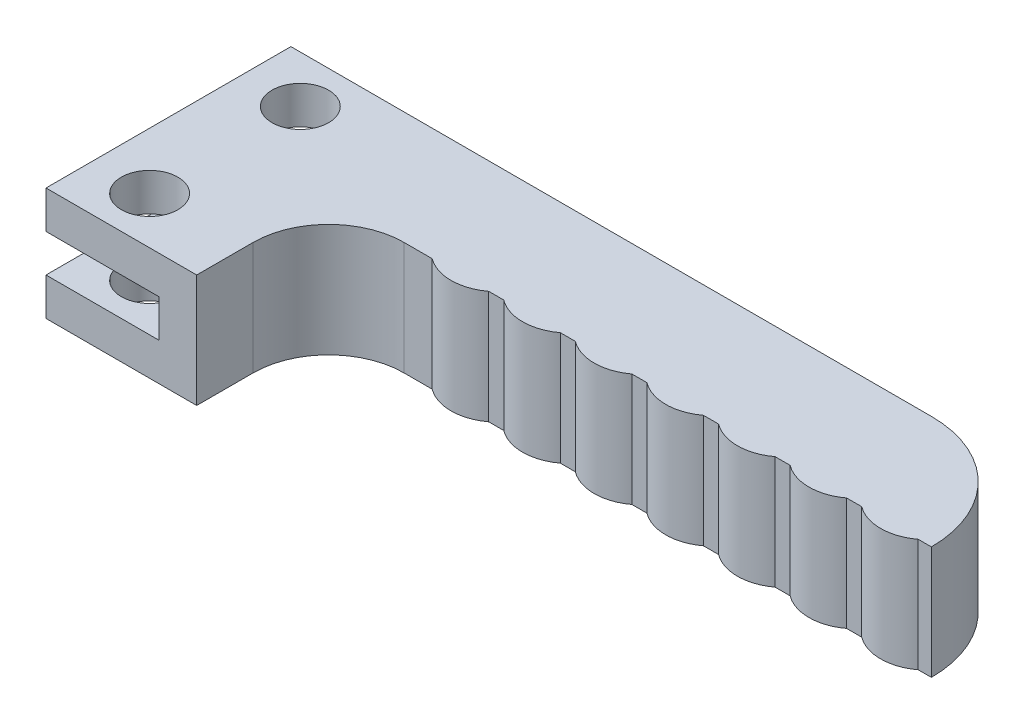
ISO-10303-21;
HEADER;
FILE_DESCRIPTION(('STEP AP214'),'2;1');
FILE_NAME('part.step','',(''),(''),'','','');
FILE_SCHEMA(('AUTOMOTIVE_DESIGN { 1 0 10303 214 1 1 1 1 }'));
ENDSEC;
DATA;
#1=APPLICATION_CONTEXT('core data for automotive mechanical design processes');
#2=APPLICATION_PROTOCOL_DEFINITION('international standard','automotive_design',2000,#1);
#3=PRODUCT_CONTEXT('',#1,'mechanical');
#4=PRODUCT('Part','Part','',(#3));
#5=PRODUCT_RELATED_PRODUCT_CATEGORY('part','',(#4));
#6=PRODUCT_DEFINITION_FORMATION('','',#4);
#7=PRODUCT_DEFINITION_CONTEXT('part definition',#1,'design');
#8=PRODUCT_DEFINITION('design','',#6,#7);
#9=PRODUCT_DEFINITION_SHAPE('','',#8);
#10=(LENGTH_UNIT() NAMED_UNIT(*) SI_UNIT(.MILLI.,.METRE.));
#11=(NAMED_UNIT(*) PLANE_ANGLE_UNIT() SI_UNIT($,.RADIAN.));
#12=(NAMED_UNIT(*) SI_UNIT($,.STERADIAN.) SOLID_ANGLE_UNIT());
#13=UNCERTAINTY_MEASURE_WITH_UNIT(LENGTH_MEASURE(1.E-05),#10,'distance_accuracy_value','');
#14=(GEOMETRIC_REPRESENTATION_CONTEXT(3) GLOBAL_UNCERTAINTY_ASSIGNED_CONTEXT((#13)) GLOBAL_UNIT_ASSIGNED_CONTEXT((#10,
#11,#12)) REPRESENTATION_CONTEXT('',''));
#15=CARTESIAN_POINT('',(0.,0.,0.));
#16=DIRECTION('',(0.,0.,1.));
#17=DIRECTION('',(1.,0.,0.));
#18=AXIS2_PLACEMENT_3D('',#15,#16,#17);
#19=CARTESIAN_POINT('',(-17.,0.,4.));
#20=DIRECTION('',(0.,1.,0.));
#21=DIRECTION('',(0.,0.,1.));
#22=AXIS2_PLACEMENT_3D('',#19,#20,#21);
#23=CYLINDRICAL_SURFACE('',#22,1.5);
#24=CARTESIAN_POINT('',(-17.,0.,4.));
#25=DIRECTION('',(0.,1.,0.));
#26=DIRECTION('',(0.,0.,1.));
#27=AXIS2_PLACEMENT_3D('',#24,#25,#26);
#28=CIRCLE('',#27,1.5);
#29=CARTESIAN_POINT('',(-17.,0.,5.5));
#30=VERTEX_POINT('',#29);
#31=EDGE_CURVE('E302',#30,#30,#28,.F.);
#32=ORIENTED_EDGE('',*,*,#31,.T.);
#33=EDGE_LOOP('',(#32));
#34=FACE_BOUND('',#33,.T.);
#35=CARTESIAN_POINT('',(-17.,2.,4.));
#36=DIRECTION('',(0.,1.,0.));
#37=DIRECTION('',(0.,0.,1.));
#38=AXIS2_PLACEMENT_3D('',#35,#36,#37);
#39=CIRCLE('',#38,1.5);
#40=CARTESIAN_POINT('',(-17.,2.,5.5));
#41=VERTEX_POINT('',#40);
#42=EDGE_CURVE('E20',#41,#41,#39,.T.);
#43=ORIENTED_EDGE('',*,*,#42,.T.);
#44=EDGE_LOOP('',(#43));
#45=FACE_BOUND('',#44,.T.);
#46=ADVANCED_FACE('F17',(#34,#45),#23,.F.);
#47=CARTESIAN_POINT('',(-17.,0.,-4.));
#48=DIRECTION('',(0.,1.,0.));
#49=DIRECTION('',(0.,0.,1.));
#50=AXIS2_PLACEMENT_3D('',#47,#48,#49);
#51=CYLINDRICAL_SURFACE('',#50,1.5);
#52=CARTESIAN_POINT('',(-17.,0.,-4.));
#53=DIRECTION('',(0.,1.,0.));
#54=DIRECTION('',(0.,0.,1.));
#55=AXIS2_PLACEMENT_3D('',#52,#53,#54);
#56=CIRCLE('',#55,1.5);
#57=CARTESIAN_POINT('',(-17.,0.,-2.5));
#58=VERTEX_POINT('',#57);
#59=EDGE_CURVE('E298',#58,#58,#56,.F.);
#60=ORIENTED_EDGE('',*,*,#59,.T.);
#61=EDGE_LOOP('',(#60));
#62=FACE_BOUND('',#61,.T.);
#63=CARTESIAN_POINT('',(-17.,2.,-4.));
#64=DIRECTION('',(0.,1.,0.));
#65=DIRECTION('',(0.,0.,1.));
#66=AXIS2_PLACEMENT_3D('',#63,#64,#65);
#67=CIRCLE('',#66,1.5);
#68=CARTESIAN_POINT('',(-17.,2.,-2.5));
#69=VERTEX_POINT('',#68);
#70=EDGE_CURVE('E190',#69,#69,#67,.T.);
#71=ORIENTED_EDGE('',*,*,#70,.T.);
#72=EDGE_LOOP('',(#71));
#73=FACE_BOUND('',#72,.T.);
#74=ADVANCED_FACE('F322',(#62,#73),#51,.F.);
#75=CARTESIAN_POINT('',(-20.,6.,6.5));
#76=DIRECTION('',(1.,0.,0.));
#77=DIRECTION('',(0.,0.,-1.));
#78=AXIS2_PLACEMENT_3D('',#75,#76,#77);
#79=PLANE('',#78);
#80=DIRECTION('',(0.,0.,-1.));
#81=VECTOR('',#80,1.);
#82=CARTESIAN_POINT('',(-20.,2.,-6.5));
#83=LINE('',#82,#81);
#84=CARTESIAN_POINT('',(-20.,2.,6.5));
#85=VERTEX_POINT('',#84);
#86=CARTESIAN_POINT('',(-20.,2.,-6.5));
#87=VERTEX_POINT('',#86);
#88=EDGE_CURVE('E179',#85,#87,#83,.T.);
#89=ORIENTED_EDGE('',*,*,#88,.T.);
#90=DIRECTION('',(0.,1.,0.));
#91=VECTOR('',#90,1.);
#92=CARTESIAN_POINT('',(-20.,6.,-6.5));
#93=LINE('',#92,#91);
#94=CARTESIAN_POINT('',(-20.,0.,-6.5));
#95=VERTEX_POINT('',#94);
#96=EDGE_CURVE('E183',#87,#95,#93,.F.);
#97=ORIENTED_EDGE('',*,*,#96,.T.);
#98=DIRECTION('',(0.,0.,1.));
#99=VECTOR('',#98,1.);
#100=CARTESIAN_POINT('',(-20.,0.,0.));
#101=LINE('',#100,#99);
#102=CARTESIAN_POINT('',(-20.,0.,6.5));
#103=VERTEX_POINT('',#102);
#104=EDGE_CURVE('E301',#95,#103,#101,.T.);
#105=ORIENTED_EDGE('',*,*,#104,.T.);
#106=DIRECTION('',(0.,1.,0.));
#107=VECTOR('',#106,1.);
#108=CARTESIAN_POINT('',(-20.,6.,6.5));
#109=LINE('',#108,#107);
#110=EDGE_CURVE('E186',#103,#85,#109,.T.);
#111=ORIENTED_EDGE('',*,*,#110,.T.);
#112=EDGE_LOOP('',(#89,#97,#105,#111));
#113=FACE_BOUND('',#112,.T.);
#114=ADVANCED_FACE('F181',(#113),#79,.F.);
#115=CARTESIAN_POINT('',(-20.,2.,-6.5));
#116=DIRECTION('',(0.,-1.,0.));
#117=DIRECTION('',(0.,0.,-1.));
#118=AXIS2_PLACEMENT_3D('',#115,#116,#117);
#119=PLANE('',#118);
#120=DIRECTION('',(0.,0.,-1.));
#121=VECTOR('',#120,1.);
#122=CARTESIAN_POINT('',(-14.,2.,-6.5));
#123=LINE('',#122,#121);
#124=CARTESIAN_POINT('',(-14.,2.,6.5));
#125=VERTEX_POINT('',#124);
#126=CARTESIAN_POINT('',(-14.,2.,-6.5));
#127=VERTEX_POINT('',#126);
#128=EDGE_CURVE('E189',#125,#127,#123,.T.);
#129=ORIENTED_EDGE('',*,*,#128,.T.);
#130=DIRECTION('',(1.,0.,0.));
#131=VECTOR('',#130,1.);
#132=CARTESIAN_POINT('',(20.,2.,-6.5));
#133=LINE('',#132,#131);
#134=EDGE_CURVE('E193',#127,#87,#133,.F.);
#135=ORIENTED_EDGE('',*,*,#134,.T.);
#136=ORIENTED_EDGE('',*,*,#88,.F.);
#137=DIRECTION('',(-1.,0.,0.));
#138=VECTOR('',#137,1.);
#139=CARTESIAN_POINT('',(20.,2.,6.5));
#140=LINE('',#139,#138);
#141=EDGE_CURVE('E467',#85,#125,#140,.F.);
#142=ORIENTED_EDGE('',*,*,#141,.T.);
#143=EDGE_LOOP('',(#129,#135,#136,#142));
#144=FACE_BOUND('',#143,.T.);
#145=ORIENTED_EDGE('',*,*,#70,.F.);
#146=EDGE_LOOP('',(#145));
#147=FACE_BOUND('',#146,.T.);
#148=ORIENTED_EDGE('',*,*,#42,.F.);
#149=EDGE_LOOP('',(#148));
#150=FACE_BOUND('',#149,.T.);
#151=ADVANCED_FACE('F194',(#144,#147,#150),#119,.F.);
#152=CARTESIAN_POINT('',(-14.,4.,-6.5));
#153=DIRECTION('',(1.,0.,0.));
#154=DIRECTION('',(0.,0.,-1.));
#155=AXIS2_PLACEMENT_3D('',#152,#153,#154);
#156=PLANE('',#155);
#157=DIRECTION('',(0.,0.,1.));
#158=VECTOR('',#157,1.);
#159=CARTESIAN_POINT('',(-14.,4.,-6.5));
#160=LINE('',#159,#158);
#161=CARTESIAN_POINT('',(-14.,4.,6.5));
#162=VERTEX_POINT('',#161);
#163=CARTESIAN_POINT('',(-14.,4.,-6.5));
#164=VERTEX_POINT('',#163);
#165=EDGE_CURVE('E155',#162,#164,#160,.F.);
#166=ORIENTED_EDGE('',*,*,#165,.T.);
#167=DIRECTION('',(0.,1.,0.));
#168=VECTOR('',#167,1.);
#169=CARTESIAN_POINT('',(-14.,6.,-6.5));
#170=LINE('',#169,#168);
#171=EDGE_CURVE('E199',#164,#127,#170,.F.);
#172=ORIENTED_EDGE('',*,*,#171,.T.);
#173=ORIENTED_EDGE('',*,*,#128,.F.);
#174=DIRECTION('',(0.,1.,0.));
#175=VECTOR('',#174,1.);
#176=CARTESIAN_POINT('',(-14.,6.,6.5));
#177=LINE('',#176,#175);
#178=EDGE_CURVE('E479',#125,#162,#177,.T.);
#179=ORIENTED_EDGE('',*,*,#178,.T.);
#180=EDGE_LOOP('',(#166,#172,#173,#179));
#181=FACE_BOUND('',#180,.T.);
#182=ADVANCED_FACE('F313',(#181),#156,.F.);
#183=CARTESIAN_POINT('',(20.,0.,-0.500000000000003));
#184=DIRECTION('',(0.,0.,-1.));
#185=DIRECTION('',(-1.,0.,0.));
#186=AXIS2_PLACEMENT_3D('',#183,#184,#185);
#187=PLANE('',#186);
#188=DIRECTION('',(0.,-1.,0.));
#189=VECTOR('',#188,1.);
#190=CARTESIAN_POINT('',(-6.50000000000001,6.,-0.5));
#191=LINE('',#190,#189);
#192=CARTESIAN_POINT('',(-6.50000000000001,6.,-0.5));
#193=VERTEX_POINT('',#192);
#194=CARTESIAN_POINT('',(-6.50000000000001,0.,-0.5));
#195=VERTEX_POINT('',#194);
#196=EDGE_CURVE('E285',#193,#195,#191,.T.);
#197=ORIENTED_EDGE('',*,*,#196,.F.);
#198=DIRECTION('',(-1.,0.,0.));
#199=VECTOR('',#198,1.);
#200=CARTESIAN_POINT('',(20.,6.,-0.500000000000003));
#201=LINE('',#200,#199);
#202=CARTESIAN_POINT('',(-8.,6.,-0.5));
#203=VERTEX_POINT('',#202);
#204=EDGE_CURVE('E432',#203,#193,#201,.F.);
#205=ORIENTED_EDGE('',*,*,#204,.F.);
#206=DIRECTION('',(0.,-1.,0.));
#207=VECTOR('',#206,1.);
#208=CARTESIAN_POINT('',(-8.,0.,-0.5));
#209=LINE('',#208,#207);
#210=CARTESIAN_POINT('',(-8.,0.,-0.5));
#211=VERTEX_POINT('',#210);
#212=EDGE_CURVE('E293',#203,#211,#209,.T.);
#213=ORIENTED_EDGE('',*,*,#212,.T.);
#214=DIRECTION('',(1.,0.,0.));
#215=VECTOR('',#214,1.);
#216=CARTESIAN_POINT('',(0.,0.,-0.5));
#217=LINE('',#216,#215);
#218=EDGE_CURVE('E435',#211,#195,#217,.T.);
#219=ORIENTED_EDGE('',*,*,#218,.T.);
#220=EDGE_LOOP('',(#197,#205,#213,#219));
#221=FACE_BOUND('',#220,.T.);
#222=ADVANCED_FACE('F320',(#221),#187,.F.);
#223=CARTESIAN_POINT('',(20.,0.,-0.500000000000003));
#224=DIRECTION('',(0.,0.,-1.));
#225=DIRECTION('',(-1.,0.,0.));
#226=AXIS2_PLACEMENT_3D('',#223,#224,#225);
#227=PLANE('',#226);
#228=DIRECTION('',(0.,-1.,0.));
#229=VECTOR('',#228,1.);
#230=CARTESIAN_POINT('',(-2.70000000000001,6.,-0.5));
#231=LINE('',#230,#229);
#232=CARTESIAN_POINT('',(-2.70000000000001,6.,-0.5));
#233=VERTEX_POINT('',#232);
#234=CARTESIAN_POINT('',(-2.70000000000001,0.,-0.5));
#235=VERTEX_POINT('',#234);
#236=EDGE_CURVE('E280',#233,#235,#231,.T.);
#237=ORIENTED_EDGE('',*,*,#236,.F.);
#238=DIRECTION('',(-1.,0.,0.));
#239=VECTOR('',#238,1.);
#240=CARTESIAN_POINT('',(20.,6.,-0.500000000000003));
#241=LINE('',#240,#239);
#242=CARTESIAN_POINT('',(-3.5,6.,-0.5));
#243=VERTEX_POINT('',#242);
#244=EDGE_CURVE('E440',#243,#233,#241,.F.);
#245=ORIENTED_EDGE('',*,*,#244,.F.);
#246=DIRECTION('',(0.,-1.,0.));
#247=VECTOR('',#246,1.);
#248=CARTESIAN_POINT('',(-3.5,6.,-0.5));
#249=LINE('',#248,#247);
#250=CARTESIAN_POINT('',(-3.5,0.,-0.5));
#251=VERTEX_POINT('',#250);
#252=EDGE_CURVE('E289',#251,#243,#249,.F.);
#253=ORIENTED_EDGE('',*,*,#252,.F.);
#254=DIRECTION('',(1.,0.,0.));
#255=VECTOR('',#254,1.);
#256=CARTESIAN_POINT('',(0.,0.,-0.5));
#257=LINE('',#256,#255);
#258=EDGE_CURVE('E538',#251,#235,#257,.T.);
#259=ORIENTED_EDGE('',*,*,#258,.T.);
#260=EDGE_LOOP('',(#237,#245,#253,#259));
#261=FACE_BOUND('',#260,.T.);
#262=ADVANCED_FACE('F420',(#261),#227,.F.);
#263=CARTESIAN_POINT('',(20.,0.,-0.500000000000003));
#264=DIRECTION('',(0.,0.,-1.));
#265=DIRECTION('',(-1.,0.,0.));
#266=AXIS2_PLACEMENT_3D('',#263,#264,#265);
#267=PLANE('',#266);
#268=DIRECTION('',(0.,-1.,0.));
#269=VECTOR('',#268,1.);
#270=CARTESIAN_POINT('',(1.09999999999999,6.,-0.5));
#271=LINE('',#270,#269);
#272=CARTESIAN_POINT('',(1.09999999999999,6.,-0.5));
#273=VERTEX_POINT('',#272);
#274=CARTESIAN_POINT('',(1.09999999999999,0.,-0.5));
#275=VERTEX_POINT('',#274);
#276=EDGE_CURVE('E275',#273,#275,#271,.T.);
#277=ORIENTED_EDGE('',*,*,#276,.F.);
#278=DIRECTION('',(-1.,0.,0.));
#279=VECTOR('',#278,1.);
#280=CARTESIAN_POINT('',(20.,6.,-0.500000000000003));
#281=LINE('',#280,#279);
#282=CARTESIAN_POINT('',(0.299999999999998,6.,-0.500000000000001));
#283=VERTEX_POINT('',#282);
#284=EDGE_CURVE('E445',#283,#273,#281,.F.);
#285=ORIENTED_EDGE('',*,*,#284,.F.);
#286=DIRECTION('',(0.,-1.,0.));
#287=VECTOR('',#286,1.);
#288=CARTESIAN_POINT('',(0.299999999999997,6.,-0.5));
#289=LINE('',#288,#287);
#290=CARTESIAN_POINT('',(0.299999999999997,0.,-0.5));
#291=VERTEX_POINT('',#290);
#292=EDGE_CURVE('E284',#291,#283,#289,.F.);
#293=ORIENTED_EDGE('',*,*,#292,.F.);
#294=DIRECTION('',(1.,0.,0.));
#295=VECTOR('',#294,1.);
#296=CARTESIAN_POINT('',(0.,0.,-0.5));
#297=LINE('',#296,#295);
#298=EDGE_CURVE('E536',#291,#275,#297,.T.);
#299=ORIENTED_EDGE('',*,*,#298,.T.);
#300=EDGE_LOOP('',(#277,#285,#293,#299));
#301=FACE_BOUND('',#300,.T.);
#302=ADVANCED_FACE('F416',(#301),#267,.F.);
#303=CARTESIAN_POINT('',(20.,0.,-0.500000000000003));
#304=DIRECTION('',(0.,0.,-1.));
#305=DIRECTION('',(-1.,0.,0.));
#306=AXIS2_PLACEMENT_3D('',#303,#304,#305);
#307=PLANE('',#306);
#308=DIRECTION('',(0.,-1.,0.));
#309=VECTOR('',#308,1.);
#310=CARTESIAN_POINT('',(4.9,6.,-0.499999999999999));
#311=LINE('',#310,#309);
#312=CARTESIAN_POINT('',(4.9,6.,-0.5));
#313=VERTEX_POINT('',#312);
#314=CARTESIAN_POINT('',(4.9,0.,-0.5));
#315=VERTEX_POINT('',#314);
#316=EDGE_CURVE('E270',#313,#315,#311,.T.);
#317=ORIENTED_EDGE('',*,*,#316,.F.);
#318=DIRECTION('',(-1.,0.,0.));
#319=VECTOR('',#318,1.);
#320=CARTESIAN_POINT('',(20.,6.,-0.500000000000003));
#321=LINE('',#320,#319);
#322=CARTESIAN_POINT('',(4.1,6.,-0.500000000000001));
#323=VERTEX_POINT('',#322);
#324=EDGE_CURVE('E544',#323,#313,#321,.F.);
#325=ORIENTED_EDGE('',*,*,#324,.F.);
#326=DIRECTION('',(0.,-1.,0.));
#327=VECTOR('',#326,1.);
#328=CARTESIAN_POINT('',(4.1,6.,-0.5));
#329=LINE('',#328,#327);
#330=CARTESIAN_POINT('',(4.1,0.,-0.5));
#331=VERTEX_POINT('',#330);
#332=EDGE_CURVE('E279',#331,#323,#329,.F.);
#333=ORIENTED_EDGE('',*,*,#332,.F.);
#334=DIRECTION('',(1.,0.,0.));
#335=VECTOR('',#334,1.);
#336=CARTESIAN_POINT('',(0.,0.,-0.5));
#337=LINE('',#336,#335);
#338=EDGE_CURVE('E534',#331,#315,#337,.T.);
#339=ORIENTED_EDGE('',*,*,#338,.T.);
#340=EDGE_LOOP('',(#317,#325,#333,#339));
#341=FACE_BOUND('',#340,.T.);
#342=ADVANCED_FACE('F412',(#341),#307,.F.);
#343=CARTESIAN_POINT('',(20.,0.,-0.500000000000003));
#344=DIRECTION('',(0.,0.,-1.));
#345=DIRECTION('',(-1.,0.,0.));
#346=AXIS2_PLACEMENT_3D('',#343,#344,#345);
#347=PLANE('',#346);
#348=DIRECTION('',(0.,-1.,0.));
#349=VECTOR('',#348,1.);
#350=CARTESIAN_POINT('',(8.7,6.,-0.5));
#351=LINE('',#350,#349);
#352=CARTESIAN_POINT('',(8.69999999999999,6.,-0.500000000000001));
#353=VERTEX_POINT('',#352);
#354=CARTESIAN_POINT('',(8.7,0.,-0.5));
#355=VERTEX_POINT('',#354);
#356=EDGE_CURVE('E265',#353,#355,#351,.T.);
#357=ORIENTED_EDGE('',*,*,#356,.F.);
#358=DIRECTION('',(-1.,0.,0.));
#359=VECTOR('',#358,1.);
#360=CARTESIAN_POINT('',(20.,6.,-0.500000000000003));
#361=LINE('',#360,#359);
#362=CARTESIAN_POINT('',(7.9,6.,-0.500000000000001));
#363=VERTEX_POINT('',#362);
#364=EDGE_CURVE('E542',#363,#353,#361,.F.);
#365=ORIENTED_EDGE('',*,*,#364,.F.);
#366=DIRECTION('',(0.,-1.,0.));
#367=VECTOR('',#366,1.);
#368=CARTESIAN_POINT('',(7.9,6.,-0.5));
#369=LINE('',#368,#367);
#370=CARTESIAN_POINT('',(7.9,0.,-0.5));
#371=VERTEX_POINT('',#370);
#372=EDGE_CURVE('E274',#371,#363,#369,.F.);
#373=ORIENTED_EDGE('',*,*,#372,.F.);
#374=DIRECTION('',(1.,0.,0.));
#375=VECTOR('',#374,1.);
#376=CARTESIAN_POINT('',(0.,0.,-0.5));
#377=LINE('',#376,#375);
#378=EDGE_CURVE('E532',#371,#355,#377,.T.);
#379=ORIENTED_EDGE('',*,*,#378,.T.);
#380=EDGE_LOOP('',(#357,#365,#373,#379));
#381=FACE_BOUND('',#380,.T.);
#382=ADVANCED_FACE('F408',(#381),#347,.F.);
#383=CARTESIAN_POINT('',(20.,0.,-0.500000000000003));
#384=DIRECTION('',(0.,0.,-1.));
#385=DIRECTION('',(-1.,0.,0.));
#386=AXIS2_PLACEMENT_3D('',#383,#384,#385);
#387=PLANE('',#386);
#388=DIRECTION('',(0.,-1.,0.));
#389=VECTOR('',#388,1.);
#390=CARTESIAN_POINT('',(12.5,6.,-0.5));
#391=LINE('',#390,#389);
#392=CARTESIAN_POINT('',(12.5,6.,-0.500000000000001));
#393=VERTEX_POINT('',#392);
#394=CARTESIAN_POINT('',(12.5,0.,-0.5));
#395=VERTEX_POINT('',#394);
#396=EDGE_CURVE('E260',#393,#395,#391,.T.);
#397=ORIENTED_EDGE('',*,*,#396,.F.);
#398=DIRECTION('',(-1.,0.,0.));
#399=VECTOR('',#398,1.);
#400=CARTESIAN_POINT('',(20.,6.,-0.500000000000003));
#401=LINE('',#400,#399);
#402=CARTESIAN_POINT('',(11.7,6.,-0.500000000000002));
#403=VERTEX_POINT('',#402);
#404=EDGE_CURVE('E304',#403,#393,#401,.F.);
#405=ORIENTED_EDGE('',*,*,#404,.F.);
#406=DIRECTION('',(0.,-1.,0.));
#407=VECTOR('',#406,1.);
#408=CARTESIAN_POINT('',(11.7,6.,-0.500000000000001));
#409=LINE('',#408,#407);
#410=CARTESIAN_POINT('',(11.7,0.,-0.500000000000001));
#411=VERTEX_POINT('',#410);
#412=EDGE_CURVE('E269',#411,#403,#409,.F.);
#413=ORIENTED_EDGE('',*,*,#412,.F.);
#414=DIRECTION('',(1.,0.,0.));
#415=VECTOR('',#414,1.);
#416=CARTESIAN_POINT('',(0.,0.,-0.5));
#417=LINE('',#416,#415);
#418=EDGE_CURVE('E530',#411,#395,#417,.T.);
#419=ORIENTED_EDGE('',*,*,#418,.T.);
#420=EDGE_LOOP('',(#397,#405,#413,#419));
#421=FACE_BOUND('',#420,.T.);
#422=ADVANCED_FACE('F404',(#421),#387,.F.);
#423=CARTESIAN_POINT('',(0.,0.,0.));
#424=DIRECTION('',(0.,1.,0.));
#425=DIRECTION('',(0.,0.,1.));
#426=AXIS2_PLACEMENT_3D('',#423,#424,#425);
#427=PLANE('',#426);
#428=CARTESIAN_POINT('',(14.,0.,-0.500000000000001));
#429=DIRECTION('',(0.,-1.,0.));
#430=DIRECTION('',(0.,0.,-1.));
#431=AXIS2_PLACEMENT_3D('',#428,#429,#430);
#432=CIRCLE('',#431,6.);
#433=CARTESIAN_POINT('',(20.,0.,-0.500000000000003));
#434=VERTEX_POINT('',#433);
#435=CARTESIAN_POINT('',(14.,0.,-6.5));
#436=VERTEX_POINT('',#435);
#437=EDGE_CURVE('E294',#434,#436,#432,.F.);
#438=ORIENTED_EDGE('',*,*,#437,.F.);
#439=DIRECTION('',(-1.,0.,0.));
#440=VECTOR('',#439,1.);
#441=CARTESIAN_POINT('',(20.,0.,-0.500000000000003));
#442=LINE('',#441,#440);
#443=CARTESIAN_POINT('',(19.3,0.,-0.500000000000002));
#444=VERTEX_POINT('',#443);
#445=EDGE_CURVE('E146',#434,#444,#442,.T.);
#446=ORIENTED_EDGE('',*,*,#445,.T.);
#447=CARTESIAN_POINT('',(17.8,0.,-2.5));
#448=DIRECTION('',(0.,-1.,0.));
#449=DIRECTION('',(0.,0.,-1.));
#450=AXIS2_PLACEMENT_3D('',#447,#448,#449);
#451=CIRCLE('',#450,2.5);
#452=CARTESIAN_POINT('',(16.3,0.,-0.500000000000001));
#453=VERTEX_POINT('',#452);
#454=EDGE_CURVE('E256',#453,#444,#451,.F.);
#455=ORIENTED_EDGE('',*,*,#454,.F.);
#456=DIRECTION('',(-1.,0.,0.));
#457=VECTOR('',#456,1.);
#458=CARTESIAN_POINT('',(20.,0.,-0.500000000000003));
#459=LINE('',#458,#457);
#460=CARTESIAN_POINT('',(15.5,0.,-0.500000000000001));
#461=VERTEX_POINT('',#460);
#462=EDGE_CURVE('E483',#453,#461,#459,.T.);
#463=ORIENTED_EDGE('',*,*,#462,.T.);
#464=CARTESIAN_POINT('',(14.,0.,-2.5));
#465=DIRECTION('',(0.,-1.,0.));
#466=DIRECTION('',(0.,0.,-1.));
#467=AXIS2_PLACEMENT_3D('',#464,#465,#466);
#468=CIRCLE('',#467,2.5);
#469=EDGE_CURVE('E261',#395,#461,#468,.F.);
#470=ORIENTED_EDGE('',*,*,#469,.F.);
#471=ORIENTED_EDGE('',*,*,#418,.F.);
#472=CARTESIAN_POINT('',(10.2,0.,-2.5));
#473=DIRECTION('',(0.,-1.,0.));
#474=DIRECTION('',(0.,0.,-1.));
#475=AXIS2_PLACEMENT_3D('',#472,#473,#474);
#476=CIRCLE('',#475,2.5);
#477=EDGE_CURVE('E266',#355,#411,#476,.F.);
#478=ORIENTED_EDGE('',*,*,#477,.F.);
#479=ORIENTED_EDGE('',*,*,#378,.F.);
#480=CARTESIAN_POINT('',(6.4,0.,-2.5));
#481=DIRECTION('',(0.,-1.,0.));
#482=DIRECTION('',(0.,0.,-1.));
#483=AXIS2_PLACEMENT_3D('',#480,#481,#482);
#484=CIRCLE('',#483,2.5);
#485=EDGE_CURVE('E271',#315,#371,#484,.F.);
#486=ORIENTED_EDGE('',*,*,#485,.F.);
#487=ORIENTED_EDGE('',*,*,#338,.F.);
#488=CARTESIAN_POINT('',(2.6,0.,-2.5));
#489=DIRECTION('',(0.,-1.,0.));
#490=DIRECTION('',(0.,0.,-1.));
#491=AXIS2_PLACEMENT_3D('',#488,#489,#490);
#492=CIRCLE('',#491,2.5);
#493=EDGE_CURVE('E276',#275,#331,#492,.F.);
#494=ORIENTED_EDGE('',*,*,#493,.F.);
#495=ORIENTED_EDGE('',*,*,#298,.F.);
#496=CARTESIAN_POINT('',(-1.2,0.,-2.5));
#497=DIRECTION('',(0.,-1.,0.));
#498=DIRECTION('',(0.,0.,-1.));
#499=AXIS2_PLACEMENT_3D('',#496,#497,#498);
#500=CIRCLE('',#499,2.5);
#501=EDGE_CURVE('E281',#235,#291,#500,.F.);
#502=ORIENTED_EDGE('',*,*,#501,.F.);
#503=ORIENTED_EDGE('',*,*,#258,.F.);
#504=CARTESIAN_POINT('',(-5.,0.,-2.5));
#505=DIRECTION('',(0.,-1.,0.));
#506=DIRECTION('',(0.,0.,-1.));
#507=AXIS2_PLACEMENT_3D('',#504,#505,#506);
#508=CIRCLE('',#507,2.5);
#509=EDGE_CURVE('E286',#195,#251,#508,.F.);
#510=ORIENTED_EDGE('',*,*,#509,.F.);
#511=ORIENTED_EDGE('',*,*,#218,.F.);
#512=CARTESIAN_POINT('',(-8.,0.,3.5));
#513=DIRECTION('',(0.,-1.,0.));
#514=DIRECTION('',(0.,0.,-1.));
#515=AXIS2_PLACEMENT_3D('',#512,#513,#514);
#516=CIRCLE('',#515,4.);
#517=CARTESIAN_POINT('',(-12.,0.,3.5));
#518=VERTEX_POINT('',#517);
#519=EDGE_CURVE('E290',#211,#518,#516,.F.);
#520=ORIENTED_EDGE('',*,*,#519,.T.);
#521=DIRECTION('',(0.,0.,1.));
#522=VECTOR('',#521,1.);
#523=CARTESIAN_POINT('',(-12.,0.,6.5));
#524=LINE('',#523,#522);
#525=CARTESIAN_POINT('',(-12.,0.,6.5));
#526=VERTEX_POINT('',#525);
#527=EDGE_CURVE('E450',#518,#526,#524,.T.);
#528=ORIENTED_EDGE('',*,*,#527,.T.);
#529=DIRECTION('',(-1.,0.,0.));
#530=VECTOR('',#529,1.);
#531=CARTESIAN_POINT('',(20.,0.,6.5));
#532=LINE('',#531,#530);
#533=EDGE_CURVE('E457',#526,#103,#532,.T.);
#534=ORIENTED_EDGE('',*,*,#533,.T.);
#535=ORIENTED_EDGE('',*,*,#104,.F.);
#536=DIRECTION('',(1.,0.,0.));
#537=VECTOR('',#536,1.);
#538=CARTESIAN_POINT('',(20.,0.,-6.5));
#539=LINE('',#538,#537);
#540=EDGE_CURVE('E205',#95,#436,#539,.T.);
#541=ORIENTED_EDGE('',*,*,#540,.T.);
#542=EDGE_LOOP('',(#438,#446,#455,#463,#470,#471,#478,#479,#486,#487,#494,#495,#502,#503,#510,
#511,#520,#528,#534,#535,#541));
#543=FACE_BOUND('',#542,.T.);
#544=ORIENTED_EDGE('',*,*,#59,.F.);
#545=EDGE_LOOP('',(#544));
#546=FACE_BOUND('',#545,.T.);
#547=ORIENTED_EDGE('',*,*,#31,.F.);
#548=EDGE_LOOP('',(#547));
#549=FACE_BOUND('',#548,.T.);
#550=ADVANCED_FACE('F401',(#543,#546,#549),#427,.F.);
#551=CARTESIAN_POINT('',(20.,0.,-0.500000000000003));
#552=DIRECTION('',(0.,0.,-1.));
#553=DIRECTION('',(-1.,0.,0.));
#554=AXIS2_PLACEMENT_3D('',#551,#552,#553);
#555=PLANE('',#554);
#556=DIRECTION('',(0.,-1.,0.));
#557=VECTOR('',#556,1.);
#558=CARTESIAN_POINT('',(19.3,6.,-0.5));
#559=LINE('',#558,#557);
#560=CARTESIAN_POINT('',(19.3,6.,-0.500000000000002));
#561=VERTEX_POINT('',#560);
#562=EDGE_CURVE('E259',#444,#561,#559,.F.);
#563=ORIENTED_EDGE('',*,*,#562,.F.);
#564=ORIENTED_EDGE('',*,*,#445,.F.);
#565=DIRECTION('',(0.,-1.,0.));
#566=VECTOR('',#565,1.);
#567=CARTESIAN_POINT('',(20.,6.,-0.500000000000003));
#568=LINE('',#567,#566);
#569=CARTESIAN_POINT('',(20.,6.,-0.500000000000003));
#570=VERTEX_POINT('',#569);
#571=EDGE_CURVE('E297',#570,#434,#568,.T.);
#572=ORIENTED_EDGE('',*,*,#571,.F.);
#573=DIRECTION('',(-1.,0.,0.));
#574=VECTOR('',#573,1.);
#575=CARTESIAN_POINT('',(20.,6.,-0.500000000000003));
#576=LINE('',#575,#574);
#577=EDGE_CURVE('E526',#561,#570,#576,.F.);
#578=ORIENTED_EDGE('',*,*,#577,.F.);
#579=EDGE_LOOP('',(#563,#564,#572,#578));
#580=FACE_BOUND('',#579,.T.);
#581=ADVANCED_FACE('F397',(#580),#555,.F.);
#582=CARTESIAN_POINT('',(20.,0.,-0.500000000000003));
#583=DIRECTION('',(0.,0.,-1.));
#584=DIRECTION('',(-1.,0.,0.));
#585=AXIS2_PLACEMENT_3D('',#582,#583,#584);
#586=PLANE('',#585);
#587=DIRECTION('',(0.,-1.,0.));
#588=VECTOR('',#587,1.);
#589=CARTESIAN_POINT('',(16.3,6.,-0.5));
#590=LINE('',#589,#588);
#591=CARTESIAN_POINT('',(16.3,6.,-0.500000000000001));
#592=VERTEX_POINT('',#591);
#593=EDGE_CURVE('E255',#592,#453,#590,.T.);
#594=ORIENTED_EDGE('',*,*,#593,.F.);
#595=DIRECTION('',(-1.,0.,0.));
#596=VECTOR('',#595,1.);
#597=CARTESIAN_POINT('',(20.,6.,-0.500000000000003));
#598=LINE('',#597,#596);
#599=CARTESIAN_POINT('',(15.5,6.,-0.500000000000001));
#600=VERTEX_POINT('',#599);
#601=EDGE_CURVE('E35',#600,#592,#598,.F.);
#602=ORIENTED_EDGE('',*,*,#601,.F.);
#603=DIRECTION('',(0.,-1.,0.));
#604=VECTOR('',#603,1.);
#605=CARTESIAN_POINT('',(15.5,6.,-0.5));
#606=LINE('',#605,#604);
#607=EDGE_CURVE('E264',#461,#600,#606,.F.);
#608=ORIENTED_EDGE('',*,*,#607,.F.);
#609=ORIENTED_EDGE('',*,*,#462,.F.);
#610=EDGE_LOOP('',(#594,#602,#608,#609));
#611=FACE_BOUND('',#610,.T.);
#612=ADVANCED_FACE('F393',(#611),#586,.F.);
#613=CARTESIAN_POINT('',(-20.,4.,-6.5));
#614=DIRECTION('',(0.,1.,0.));
#615=DIRECTION('',(-1.,0.,0.));
#616=AXIS2_PLACEMENT_3D('',#613,#614,#615);
#617=PLANE('',#616);
#618=DIRECTION('',(0.,0.,-1.));
#619=VECTOR('',#618,1.);
#620=CARTESIAN_POINT('',(-20.,4.,6.5));
#621=LINE('',#620,#619);
#622=CARTESIAN_POINT('',(-20.,4.,6.5));
#623=VERTEX_POINT('',#622);
#624=CARTESIAN_POINT('',(-20.,4.,-6.5));
#625=VERTEX_POINT('',#624);
#626=EDGE_CURVE('E471',#623,#625,#621,.T.);
#627=ORIENTED_EDGE('',*,*,#626,.T.);
#628=DIRECTION('',(1.,0.,0.));
#629=VECTOR('',#628,1.);
#630=CARTESIAN_POINT('',(20.,4.,-6.5));
#631=LINE('',#630,#629);
#632=EDGE_CURVE('E217',#625,#164,#631,.T.);
#633=ORIENTED_EDGE('',*,*,#632,.T.);
#634=ORIENTED_EDGE('',*,*,#165,.F.);
#635=DIRECTION('',(-1.,0.,0.));
#636=VECTOR('',#635,1.);
#637=CARTESIAN_POINT('',(20.,4.,6.5));
#638=LINE('',#637,#636);
#639=EDGE_CURVE('E476',#162,#623,#638,.T.);
#640=ORIENTED_EDGE('',*,*,#639,.T.);
#641=EDGE_LOOP('',(#627,#633,#634,#640));
#642=FACE_BOUND('',#641,.T.);
#643=CARTESIAN_POINT('',(-17.,4.,-4.));
#644=DIRECTION('',(0.,1.,0.));
#645=DIRECTION('',(0.,0.,1.));
#646=AXIS2_PLACEMENT_3D('',#643,#644,#645);
#647=CIRCLE('',#646,1.5);
#648=CARTESIAN_POINT('',(-17.,4.,-2.5));
#649=VERTEX_POINT('',#648);
#650=EDGE_CURVE('E249',#649,#649,#647,.T.);
#651=ORIENTED_EDGE('',*,*,#650,.T.);
#652=EDGE_LOOP('',(#651));
#653=FACE_BOUND('',#652,.T.);
#654=CARTESIAN_POINT('',(-17.,4.,4.));
#655=DIRECTION('',(0.,1.,0.));
#656=DIRECTION('',(0.,0.,1.));
#657=AXIS2_PLACEMENT_3D('',#654,#655,#656);
#658=CIRCLE('',#657,1.5);
#659=CARTESIAN_POINT('',(-17.,4.,5.5));
#660=VERTEX_POINT('',#659);
#661=EDGE_CURVE('E252',#660,#660,#658,.T.);
#662=ORIENTED_EDGE('',*,*,#661,.T.);
#663=EDGE_LOOP('',(#662));
#664=FACE_BOUND('',#663,.T.);
#665=ADVANCED_FACE('F389',(#642,#653,#664),#617,.F.);
#666=CARTESIAN_POINT('',(14.,6.,-0.500000000000001));
#667=DIRECTION('',(0.,-1.,0.));
#668=DIRECTION('',(0.,0.,-1.));
#669=AXIS2_PLACEMENT_3D('',#666,#667,#668);
#670=CYLINDRICAL_SURFACE('',#669,6.);
#671=ORIENTED_EDGE('',*,*,#437,.T.);
#672=DIRECTION('',(0.,1.,0.));
#673=VECTOR('',#672,1.);
#674=CARTESIAN_POINT('',(14.,6.,-6.5));
#675=LINE('',#674,#673);
#676=CARTESIAN_POINT('',(14.,6.,-6.5));
#677=VERTEX_POINT('',#676);
#678=EDGE_CURVE('E207',#436,#677,#675,.T.);
#679=ORIENTED_EDGE('',*,*,#678,.T.);
#680=CARTESIAN_POINT('',(14.,6.,-0.500000000000001));
#681=DIRECTION('',(0.,-1.,0.));
#682=DIRECTION('',(0.,0.,-1.));
#683=AXIS2_PLACEMENT_3D('',#680,#681,#682);
#684=CIRCLE('',#683,6.);
#685=EDGE_CURVE('E245',#570,#677,#684,.F.);
#686=ORIENTED_EDGE('',*,*,#685,.F.);
#687=ORIENTED_EDGE('',*,*,#571,.T.);
#688=EDGE_LOOP('',(#671,#679,#686,#687));
#689=FACE_BOUND('',#688,.T.);
#690=ADVANCED_FACE('F386',(#689),#670,.T.);
#691=CARTESIAN_POINT('',(20.,6.,-6.5));
#692=DIRECTION('',(0.,0.,1.));
#693=DIRECTION('',(1.,0.,0.));
#694=AXIS2_PLACEMENT_3D('',#691,#692,#693);
#695=PLANE('',#694);
#696=ORIENTED_EDGE('',*,*,#678,.F.);
#697=ORIENTED_EDGE('',*,*,#540,.F.);
#698=ORIENTED_EDGE('',*,*,#96,.F.);
#699=ORIENTED_EDGE('',*,*,#134,.F.);
#700=ORIENTED_EDGE('',*,*,#171,.F.);
#701=ORIENTED_EDGE('',*,*,#632,.F.);
#702=DIRECTION('',(0.,1.,0.));
#703=VECTOR('',#702,1.);
#704=CARTESIAN_POINT('',(-20.,6.,-6.5));
#705=LINE('',#704,#703);
#706=CARTESIAN_POINT('',(-20.,6.,-6.5));
#707=VERTEX_POINT('',#706);
#708=EDGE_CURVE('E468',#625,#707,#705,.T.);
#709=ORIENTED_EDGE('',*,*,#708,.T.);
#710=DIRECTION('',(1.,0.,0.));
#711=VECTOR('',#710,1.);
#712=CARTESIAN_POINT('',(0.,6.,-6.5));
#713=LINE('',#712,#711);
#714=EDGE_CURVE('E248',#677,#707,#713,.F.);
#715=ORIENTED_EDGE('',*,*,#714,.F.);
#716=EDGE_LOOP('',(#696,#697,#698,#699,#700,#701,#709,#715));
#717=FACE_BOUND('',#716,.T.);
#718=ADVANCED_FACE('F203',(#717),#695,.F.);
#719=CARTESIAN_POINT('',(-20.,6.,6.5));
#720=DIRECTION('',(1.,0.,0.));
#721=DIRECTION('',(0.,0.,-1.));
#722=AXIS2_PLACEMENT_3D('',#719,#720,#721);
#723=PLANE('',#722);
#724=ORIENTED_EDGE('',*,*,#626,.F.);
#725=DIRECTION('',(0.,1.,0.));
#726=VECTOR('',#725,1.);
#727=CARTESIAN_POINT('',(-20.,6.,6.5));
#728=LINE('',#727,#726);
#729=CARTESIAN_POINT('',(-20.,6.,6.5));
#730=VERTEX_POINT('',#729);
#731=EDGE_CURVE('E460',#623,#730,#728,.T.);
#732=ORIENTED_EDGE('',*,*,#731,.T.);
#733=DIRECTION('',(0.,0.,1.));
#734=VECTOR('',#733,1.);
#735=CARTESIAN_POINT('',(-20.,6.,0.));
#736=LINE('',#735,#734);
#737=EDGE_CURVE('E512',#707,#730,#736,.T.);
#738=ORIENTED_EDGE('',*,*,#737,.F.);
#739=ORIENTED_EDGE('',*,*,#708,.F.);
#740=EDGE_LOOP('',(#724,#732,#738,#739));
#741=FACE_BOUND('',#740,.T.);
#742=ADVANCED_FACE('F379',(#741),#723,.F.);
#743=CARTESIAN_POINT('',(20.,6.,6.5));
#744=DIRECTION('',(0.,0.,-1.));
#745=DIRECTION('',(-1.,0.,0.));
#746=AXIS2_PLACEMENT_3D('',#743,#744,#745);
#747=PLANE('',#746);
#748=DIRECTION('',(0.,1.,0.));
#749=VECTOR('',#748,1.);
#750=CARTESIAN_POINT('',(-12.,0.,6.5));
#751=LINE('',#750,#749);
#752=CARTESIAN_POINT('',(-12.,6.,6.5));
#753=VERTEX_POINT('',#752);
#754=EDGE_CURVE('E454',#526,#753,#751,.T.);
#755=ORIENTED_EDGE('',*,*,#754,.T.);
#756=DIRECTION('',(1.,0.,0.));
#757=VECTOR('',#756,1.);
#758=CARTESIAN_POINT('',(0.,6.,6.5));
#759=LINE('',#758,#757);
#760=EDGE_CURVE('E568',#730,#753,#759,.T.);
#761=ORIENTED_EDGE('',*,*,#760,.F.);
#762=ORIENTED_EDGE('',*,*,#731,.F.);
#763=ORIENTED_EDGE('',*,*,#639,.F.);
#764=ORIENTED_EDGE('',*,*,#178,.F.);
#765=ORIENTED_EDGE('',*,*,#141,.F.);
#766=ORIENTED_EDGE('',*,*,#110,.F.);
#767=ORIENTED_EDGE('',*,*,#533,.F.);
#768=EDGE_LOOP('',(#755,#761,#762,#763,#764,#765,#766,#767));
#769=FACE_BOUND('',#768,.T.);
#770=ADVANCED_FACE('F375',(#769),#747,.F.);
#771=CARTESIAN_POINT('',(-12.,0.,6.5));
#772=DIRECTION('',(-1.,0.,0.));
#773=DIRECTION('',(0.,0.,1.));
#774=AXIS2_PLACEMENT_3D('',#771,#772,#773);
#775=PLANE('',#774);
#776=DIRECTION('',(0.,-1.,0.));
#777=VECTOR('',#776,1.);
#778=CARTESIAN_POINT('',(-12.,0.,3.5));
#779=LINE('',#778,#777);
#780=CARTESIAN_POINT('',(-12.,6.,3.5));
#781=VERTEX_POINT('',#780);
#782=EDGE_CURVE('E453',#518,#781,#779,.F.);
#783=ORIENTED_EDGE('',*,*,#782,.T.);
#784=DIRECTION('',(0.,0.,1.));
#785=VECTOR('',#784,1.);
#786=CARTESIAN_POINT('',(-12.,6.,0.));
#787=LINE('',#786,#785);
#788=EDGE_CURVE('E244',#753,#781,#787,.F.);
#789=ORIENTED_EDGE('',*,*,#788,.F.);
#790=ORIENTED_EDGE('',*,*,#754,.F.);
#791=ORIENTED_EDGE('',*,*,#527,.F.);
#792=EDGE_LOOP('',(#783,#789,#790,#791));
#793=FACE_BOUND('',#792,.T.);
#794=ADVANCED_FACE('F371',(#793),#775,.F.);
#795=CARTESIAN_POINT('',(-8.,0.,3.5));
#796=DIRECTION('',(0.,-1.,0.));
#797=DIRECTION('',(0.,0.,-1.));
#798=AXIS2_PLACEMENT_3D('',#795,#796,#797);
#799=CYLINDRICAL_SURFACE('',#798,4.);
#800=ORIENTED_EDGE('',*,*,#212,.F.);
#801=CARTESIAN_POINT('',(-8.,6.,3.5));
#802=DIRECTION('',(0.,-1.,0.));
#803=DIRECTION('',(0.,0.,-1.));
#804=AXIS2_PLACEMENT_3D('',#801,#802,#803);
#805=CIRCLE('',#804,4.);
#806=EDGE_CURVE('E241',#781,#203,#805,.T.);
#807=ORIENTED_EDGE('',*,*,#806,.F.);
#808=ORIENTED_EDGE('',*,*,#782,.F.);
#809=ORIENTED_EDGE('',*,*,#519,.F.);
#810=EDGE_LOOP('',(#800,#807,#808,#809));
#811=FACE_BOUND('',#810,.T.);
#812=ADVANCED_FACE('F367',(#811),#799,.F.);
#813=CARTESIAN_POINT('',(-5.,6.,-2.5));
#814=DIRECTION('',(0.,-1.,0.));
#815=DIRECTION('',(0.,0.,-1.));
#816=AXIS2_PLACEMENT_3D('',#813,#814,#815);
#817=CYLINDRICAL_SURFACE('',#816,2.5);
#818=CARTESIAN_POINT('',(-5.,6.,-2.5));
#819=DIRECTION('',(0.,-1.,0.));
#820=DIRECTION('',(0.,0.,-1.));
#821=AXIS2_PLACEMENT_3D('',#818,#819,#820);
#822=CIRCLE('',#821,2.5);
#823=EDGE_CURVE('E238',#193,#243,#822,.F.);
#824=ORIENTED_EDGE('',*,*,#823,.F.);
#825=ORIENTED_EDGE('',*,*,#196,.T.);
#826=ORIENTED_EDGE('',*,*,#509,.T.);
#827=ORIENTED_EDGE('',*,*,#252,.T.);
#828=EDGE_LOOP('',(#824,#825,#826,#827));
#829=FACE_BOUND('',#828,.T.);
#830=ADVANCED_FACE('F363',(#829),#817,.T.);
#831=CARTESIAN_POINT('',(-1.2,6.,-2.5));
#832=DIRECTION('',(0.,-1.,0.));
#833=DIRECTION('',(0.,0.,-1.));
#834=AXIS2_PLACEMENT_3D('',#831,#832,#833);
#835=CYLINDRICAL_SURFACE('',#834,2.5);
#836=CARTESIAN_POINT('',(-1.2,6.,-2.5));
#837=DIRECTION('',(0.,-1.,0.));
#838=DIRECTION('',(0.,0.,-1.));
#839=AXIS2_PLACEMENT_3D('',#836,#837,#838);
#840=CIRCLE('',#839,2.5);
#841=EDGE_CURVE('E235',#233,#283,#840,.F.);
#842=ORIENTED_EDGE('',*,*,#841,.F.);
#843=ORIENTED_EDGE('',*,*,#236,.T.);
#844=ORIENTED_EDGE('',*,*,#501,.T.);
#845=ORIENTED_EDGE('',*,*,#292,.T.);
#846=EDGE_LOOP('',(#842,#843,#844,#845));
#847=FACE_BOUND('',#846,.T.);
#848=ADVANCED_FACE('F359',(#847),#835,.T.);
#849=CARTESIAN_POINT('',(2.6,6.,-2.5));
#850=DIRECTION('',(0.,-1.,0.));
#851=DIRECTION('',(0.,0.,-1.));
#852=AXIS2_PLACEMENT_3D('',#849,#850,#851);
#853=CYLINDRICAL_SURFACE('',#852,2.5);
#854=CARTESIAN_POINT('',(2.6,6.,-2.5));
#855=DIRECTION('',(0.,-1.,0.));
#856=DIRECTION('',(0.,0.,-1.));
#857=AXIS2_PLACEMENT_3D('',#854,#855,#856);
#858=CIRCLE('',#857,2.5);
#859=EDGE_CURVE('E232',#273,#323,#858,.F.);
#860=ORIENTED_EDGE('',*,*,#859,.F.);
#861=ORIENTED_EDGE('',*,*,#276,.T.);
#862=ORIENTED_EDGE('',*,*,#493,.T.);
#863=ORIENTED_EDGE('',*,*,#332,.T.);
#864=EDGE_LOOP('',(#860,#861,#862,#863));
#865=FACE_BOUND('',#864,.T.);
#866=ADVANCED_FACE('F355',(#865),#853,.T.);
#867=CARTESIAN_POINT('',(6.4,6.,-2.5));
#868=DIRECTION('',(0.,-1.,0.));
#869=DIRECTION('',(0.,0.,-1.));
#870=AXIS2_PLACEMENT_3D('',#867,#868,#869);
#871=CYLINDRICAL_SURFACE('',#870,2.5);
#872=CARTESIAN_POINT('',(6.4,6.,-2.5));
#873=DIRECTION('',(0.,-1.,0.));
#874=DIRECTION('',(0.,0.,-1.));
#875=AXIS2_PLACEMENT_3D('',#872,#873,#874);
#876=CIRCLE('',#875,2.5);
#877=EDGE_CURVE('E229',#313,#363,#876,.F.);
#878=ORIENTED_EDGE('',*,*,#877,.F.);
#879=ORIENTED_EDGE('',*,*,#316,.T.);
#880=ORIENTED_EDGE('',*,*,#485,.T.);
#881=ORIENTED_EDGE('',*,*,#372,.T.);
#882=EDGE_LOOP('',(#878,#879,#880,#881));
#883=FACE_BOUND('',#882,.T.);
#884=ADVANCED_FACE('F351',(#883),#871,.T.);
#885=CARTESIAN_POINT('',(10.2,6.,-2.5));
#886=DIRECTION('',(0.,-1.,0.));
#887=DIRECTION('',(0.,0.,-1.));
#888=AXIS2_PLACEMENT_3D('',#885,#886,#887);
#889=CYLINDRICAL_SURFACE('',#888,2.5);
#890=CARTESIAN_POINT('',(10.2,6.,-2.5));
#891=DIRECTION('',(0.,-1.,0.));
#892=DIRECTION('',(0.,0.,-1.));
#893=AXIS2_PLACEMENT_3D('',#890,#891,#892);
#894=CIRCLE('',#893,2.5);
#895=EDGE_CURVE('E226',#353,#403,#894,.F.);
#896=ORIENTED_EDGE('',*,*,#895,.F.);
#897=ORIENTED_EDGE('',*,*,#356,.T.);
#898=ORIENTED_EDGE('',*,*,#477,.T.);
#899=ORIENTED_EDGE('',*,*,#412,.T.);
#900=EDGE_LOOP('',(#896,#897,#898,#899));
#901=FACE_BOUND('',#900,.T.);
#902=ADVANCED_FACE('F347',(#901),#889,.T.);
#903=CARTESIAN_POINT('',(14.,6.,-2.5));
#904=DIRECTION('',(0.,-1.,0.));
#905=DIRECTION('',(0.,0.,-1.));
#906=AXIS2_PLACEMENT_3D('',#903,#904,#905);
#907=CYLINDRICAL_SURFACE('',#906,2.5);
#908=CARTESIAN_POINT('',(14.,6.,-2.5));
#909=DIRECTION('',(0.,-1.,0.));
#910=DIRECTION('',(0.,0.,-1.));
#911=AXIS2_PLACEMENT_3D('',#908,#909,#910);
#912=CIRCLE('',#911,2.5);
#913=EDGE_CURVE('E224',#393,#600,#912,.F.);
#914=ORIENTED_EDGE('',*,*,#913,.F.);
#915=ORIENTED_EDGE('',*,*,#396,.T.);
#916=ORIENTED_EDGE('',*,*,#469,.T.);
#917=ORIENTED_EDGE('',*,*,#607,.T.);
#918=EDGE_LOOP('',(#914,#915,#916,#917));
#919=FACE_BOUND('',#918,.T.);
#920=ADVANCED_FACE('F343',(#919),#907,.T.);
#921=CARTESIAN_POINT('',(17.8,6.,-2.5));
#922=DIRECTION('',(0.,-1.,0.));
#923=DIRECTION('',(0.,0.,-1.));
#924=AXIS2_PLACEMENT_3D('',#921,#922,#923);
#925=CYLINDRICAL_SURFACE('',#924,2.5);
#926=CARTESIAN_POINT('',(17.8,6.,-2.5));
#927=DIRECTION('',(0.,-1.,0.));
#928=DIRECTION('',(0.,0.,-1.));
#929=AXIS2_PLACEMENT_3D('',#926,#927,#928);
#930=CIRCLE('',#929,2.5);
#931=EDGE_CURVE('E222',#592,#561,#930,.F.);
#932=ORIENTED_EDGE('',*,*,#931,.F.);
#933=ORIENTED_EDGE('',*,*,#593,.T.);
#934=ORIENTED_EDGE('',*,*,#454,.T.);
#935=ORIENTED_EDGE('',*,*,#562,.T.);
#936=EDGE_LOOP('',(#932,#933,#934,#935));
#937=FACE_BOUND('',#936,.T.);
#938=ADVANCED_FACE('F339',(#937),#925,.T.);
#939=CARTESIAN_POINT('',(-17.,4.,4.));
#940=DIRECTION('',(0.,1.,0.));
#941=DIRECTION('',(0.,0.,1.));
#942=AXIS2_PLACEMENT_3D('',#939,#940,#941);
#943=CYLINDRICAL_SURFACE('',#942,1.5);
#944=CARTESIAN_POINT('',(-17.,6.,4.));
#945=DIRECTION('',(0.,1.,0.));
#946=DIRECTION('',(0.,0.,1.));
#947=AXIS2_PLACEMENT_3D('',#944,#945,#946);
#948=CIRCLE('',#947,1.5);
#949=CARTESIAN_POINT('',(-17.,6.,5.5));
#950=VERTEX_POINT('',#949);
#951=EDGE_CURVE('E26',#950,#950,#948,.F.);
#952=ORIENTED_EDGE('',*,*,#951,.F.);
#953=EDGE_LOOP('',(#952));
#954=FACE_BOUND('',#953,.T.);
#955=ORIENTED_EDGE('',*,*,#661,.F.);
#956=EDGE_LOOP('',(#955));
#957=FACE_BOUND('',#956,.T.);
#958=ADVANCED_FACE('F332',(#954,#957),#943,.F.);
#959=CARTESIAN_POINT('',(-17.,4.,-4.));
#960=DIRECTION('',(0.,1.,0.));
#961=DIRECTION('',(0.,0.,1.));
#962=AXIS2_PLACEMENT_3D('',#959,#960,#961);
#963=CYLINDRICAL_SURFACE('',#962,1.5);
#964=CARTESIAN_POINT('',(-17.,6.,-4.));
#965=DIRECTION('',(0.,1.,0.));
#966=DIRECTION('',(0.,0.,1.));
#967=AXIS2_PLACEMENT_3D('',#964,#965,#966);
#968=CIRCLE('',#967,1.5);
#969=CARTESIAN_POINT('',(-17.,6.,-2.5));
#970=VERTEX_POINT('',#969);
#971=EDGE_CURVE('E11',#970,#970,#968,.F.);
#972=ORIENTED_EDGE('',*,*,#971,.F.);
#973=EDGE_LOOP('',(#972));
#974=FACE_BOUND('',#973,.T.);
#975=ORIENTED_EDGE('',*,*,#650,.F.);
#976=EDGE_LOOP('',(#975));
#977=FACE_BOUND('',#976,.T.);
#978=ADVANCED_FACE('F326',(#974,#977),#963,.F.);
#979=CARTESIAN_POINT('',(0.,6.,0.));
#980=DIRECTION('',(0.,1.,0.));
#981=DIRECTION('',(0.,0.,1.));
#982=AXIS2_PLACEMENT_3D('',#979,#980,#981);
#983=PLANE('',#982);
#984=ORIENTED_EDGE('',*,*,#971,.T.);
#985=EDGE_LOOP('',(#984));
#986=FACE_BOUND('',#985,.T.);
#987=ORIENTED_EDGE('',*,*,#951,.T.);
#988=EDGE_LOOP('',(#987));
#989=FACE_BOUND('',#988,.T.);
#990=ORIENTED_EDGE('',*,*,#601,.T.);
#991=ORIENTED_EDGE('',*,*,#931,.T.);
#992=ORIENTED_EDGE('',*,*,#577,.T.);
#993=ORIENTED_EDGE('',*,*,#685,.T.);
#994=ORIENTED_EDGE('',*,*,#714,.T.);
#995=ORIENTED_EDGE('',*,*,#737,.T.);
#996=ORIENTED_EDGE('',*,*,#760,.T.);
#997=ORIENTED_EDGE('',*,*,#788,.T.);
#998=ORIENTED_EDGE('',*,*,#806,.T.);
#999=ORIENTED_EDGE('',*,*,#204,.T.);
#1000=ORIENTED_EDGE('',*,*,#823,.T.);
#1001=ORIENTED_EDGE('',*,*,#244,.T.);
#1002=ORIENTED_EDGE('',*,*,#841,.T.);
#1003=ORIENTED_EDGE('',*,*,#284,.T.);
#1004=ORIENTED_EDGE('',*,*,#859,.T.);
#1005=ORIENTED_EDGE('',*,*,#324,.T.);
#1006=ORIENTED_EDGE('',*,*,#877,.T.);
#1007=ORIENTED_EDGE('',*,*,#364,.T.);
#1008=ORIENTED_EDGE('',*,*,#895,.T.);
#1009=ORIENTED_EDGE('',*,*,#404,.T.);
#1010=ORIENTED_EDGE('',*,*,#913,.T.);
#1011=EDGE_LOOP('',(#990,#991,#992,#993,#994,#995,#996,#997,#998,#999,#1000,#1001,#1002,#1003,
#1004,#1005,#1006,#1007,#1008,#1009,#1010));
#1012=FACE_BOUND('',#1011,.T.);
#1013=ADVANCED_FACE('F324',(#986,#989,#1012),#983,.T.);
#1014=CLOSED_SHELL('',(#46,#74,#114,#151,#182,#222,#262,#302,#342,#382,#422,#550,#581,#612,#665,
#690,#718,#742,#770,#794,#812,#830,#848,#866,#884,#902,#920,#938,#958,#978,#1013));
#1015=MANIFOLD_SOLID_BREP('B1',#1014);
#1016=ADVANCED_BREP_SHAPE_REPRESENTATION('',(#18,#1015),#14);
#1017=SHAPE_DEFINITION_REPRESENTATION(#9,#1016);
ENDSEC;
END-ISO-10303-21;
